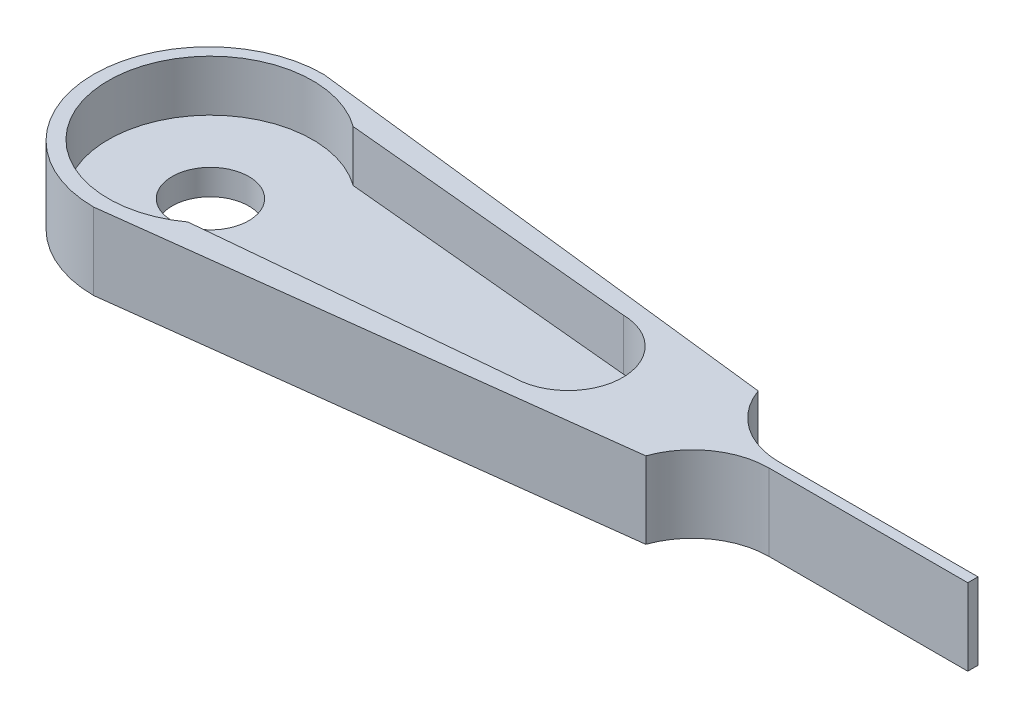
ISO-10303-21;
HEADER;
FILE_DESCRIPTION(('STEP AP214'),'2;1');
FILE_NAME('part.step','',(''),(''),'','','');
FILE_SCHEMA(('AUTOMOTIVE_DESIGN { 1 0 10303 214 1 1 1 1 }'));
ENDSEC;
DATA;
#1=APPLICATION_CONTEXT('core data for automotive mechanical design processes');
#2=APPLICATION_PROTOCOL_DEFINITION('international standard','automotive_design',2000,#1);
#3=PRODUCT_CONTEXT('',#1,'mechanical');
#4=PRODUCT('Part','Part','',(#3));
#5=PRODUCT_RELATED_PRODUCT_CATEGORY('part','',(#4));
#6=PRODUCT_DEFINITION_FORMATION('','',#4);
#7=PRODUCT_DEFINITION_CONTEXT('part definition',#1,'design');
#8=PRODUCT_DEFINITION('design','',#6,#7);
#9=PRODUCT_DEFINITION_SHAPE('','',#8);
#10=(LENGTH_UNIT() NAMED_UNIT(*) SI_UNIT(.MILLI.,.METRE.));
#11=(NAMED_UNIT(*) PLANE_ANGLE_UNIT() SI_UNIT($,.RADIAN.));
#12=(NAMED_UNIT(*) SI_UNIT($,.STERADIAN.) SOLID_ANGLE_UNIT());
#13=UNCERTAINTY_MEASURE_WITH_UNIT(LENGTH_MEASURE(1.E-05),#10,'distance_accuracy_value','');
#14=(GEOMETRIC_REPRESENTATION_CONTEXT(3) GLOBAL_UNCERTAINTY_ASSIGNED_CONTEXT((#13)) GLOBAL_UNIT_ASSIGNED_CONTEXT((#10,
#11,#12)) REPRESENTATION_CONTEXT('',''));
#15=CARTESIAN_POINT('',(0.,0.,0.));
#16=DIRECTION('',(0.,0.,1.));
#17=DIRECTION('',(1.,0.,0.));
#18=AXIS2_PLACEMENT_3D('',#15,#16,#17);
#19=CARTESIAN_POINT('',(-26.9871078638368,1.,0.));
#20=DIRECTION('',(0.,-1.,0.));
#21=DIRECTION('',(0.,0.,-1.));
#22=AXIS2_PLACEMENT_3D('',#19,#20,#21);
#23=CYLINDRICAL_SURFACE('',#22,1.5);
#24=CARTESIAN_POINT('',(-26.9871078638368,1.,0.));
#25=DIRECTION('',(0.,1.,0.));
#26=DIRECTION('',(0.,0.,1.));
#27=AXIS2_PLACEMENT_3D('',#24,#25,#26);
#28=CIRCLE('',#27,1.5);
#29=CARTESIAN_POINT('',(-26.9871078638368,1.,1.5));
#30=VERTEX_POINT('',#29);
#31=EDGE_CURVE('E253',#30,#30,#28,.T.);
#32=ORIENTED_EDGE('',*,*,#31,.T.);
#33=EDGE_LOOP('',(#32));
#34=FACE_BOUND('',#33,.T.);
#35=CARTESIAN_POINT('',(-26.9871078638368,0.,0.));
#36=DIRECTION('',(0.,1.,0.));
#37=DIRECTION('',(0.,0.,1.));
#38=AXIS2_PLACEMENT_3D('',#35,#36,#37);
#39=CIRCLE('',#38,1.5);
#40=CARTESIAN_POINT('',(-26.9871078638368,0.,1.5));
#41=VERTEX_POINT('',#40);
#42=EDGE_CURVE('E232',#41,#41,#39,.T.);
#43=ORIENTED_EDGE('',*,*,#42,.F.);
#44=EDGE_LOOP('',(#43));
#45=FACE_BOUND('',#44,.T.);
#46=ADVANCED_FACE('F45',(#34,#45),#23,.F.);
#47=CARTESIAN_POINT('',(0.,1.,0.));
#48=DIRECTION('',(0.,1.,0.));
#49=DIRECTION('',(0.,0.,1.));
#50=AXIS2_PLACEMENT_3D('',#47,#48,#49);
#51=PLANE('',#50);
#52=CARTESIAN_POINT('',(-26.9871078638368,1.,0.));
#53=DIRECTION('',(0.,1.,0.));
#54=DIRECTION('',(0.,0.,1.));
#55=AXIS2_PLACEMENT_3D('',#52,#53,#54);
#56=CIRCLE('',#55,4.);
#57=CARTESIAN_POINT('',(-24.6336953234997,1.,-3.23441639480509));
#58=VERTEX_POINT('',#57);
#59=CARTESIAN_POINT('',(-24.6336953234997,1.,3.23441639480509));
#60=VERTEX_POINT('',#59);
#61=EDGE_CURVE('E240',#58,#60,#56,.T.);
#62=ORIENTED_EDGE('',*,*,#61,.T.);
#63=DIRECTION('',(-0.995556490145002,0.,0.0941662090676083));
#64=VECTOR('',#63,1.);
#65=CARTESIAN_POINT('',(0.0847856095362401,1.,0.896381671094999));
#66=LINE('',#65,#64);
#67=CARTESIAN_POINT('',(-12.9619425776495,1.,2.13042609377146));
#68=VERTEX_POINT('',#67);
#69=EDGE_CURVE('E153',#68,#60,#66,.T.);
#70=ORIENTED_EDGE('',*,*,#69,.F.);
#71=CARTESIAN_POINT('',(-12.9871078638368,1.,0.));
#72=DIRECTION('',(0.,1.,0.));
#73=DIRECTION('',(0.,0.,1.));
#74=AXIS2_PLACEMENT_3D('',#71,#72,#73);
#75=CIRCLE('',#74,2.13057471886137);
#76=CARTESIAN_POINT('',(-12.9619425776495,1.,-2.13042609377146));
#77=VERTEX_POINT('',#76);
#78=EDGE_CURVE('E245',#68,#77,#75,.T.);
#79=ORIENTED_EDGE('',*,*,#78,.T.);
#80=DIRECTION('',(0.995556490145002,0.,0.0941662090676083));
#81=VECTOR('',#80,1.);
#82=CARTESIAN_POINT('',(0.0847856095362401,1.,-0.896381671094999));
#83=LINE('',#82,#81);
#84=EDGE_CURVE('E249',#58,#77,#83,.T.);
#85=ORIENTED_EDGE('',*,*,#84,.F.);
#86=EDGE_LOOP('',(#62,#70,#79,#85));
#87=FACE_BOUND('',#86,.T.);
#88=ORIENTED_EDGE('',*,*,#31,.F.);
#89=EDGE_LOOP('',(#88));
#90=FACE_BOUND('',#89,.T.);
#91=ADVANCED_FACE('F313',(#87,#90),#51,.T.);
#92=CARTESIAN_POINT('',(0.,0.,0.));
#93=DIRECTION('',(0.,1.,0.));
#94=DIRECTION('',(0.,0.,1.));
#95=AXIS2_PLACEMENT_3D('',#92,#93,#94);
#96=PLANE('',#95);
#97=ORIENTED_EDGE('',*,*,#42,.T.);
#98=EDGE_LOOP('',(#97));
#99=FACE_BOUND('',#98,.T.);
#100=CARTESIAN_POINT('',(-26.9871078638368,0.,0.0716470360661251));
#101=DIRECTION('',(0.,1.,0.));
#102=DIRECTION('',(0.,0.,1.));
#103=AXIS2_PLACEMENT_3D('',#100,#101,#102);
#104=CIRCLE('',#103,4.5);
#105=CARTESIAN_POINT('',(-26.9871078638368,0.,-4.42835296393388));
#106=VERTEX_POINT('',#105);
#107=CARTESIAN_POINT('',(-26.9871078638368,0.,4.57164703606613));
#108=VERTEX_POINT('',#107);
#109=EDGE_CURVE('E192',#106,#108,#104,.T.);
#110=ORIENTED_EDGE('',*,*,#109,.F.);
#111=DIRECTION('',(0.993357961620938,0.,0.115065025460798));
#112=VECTOR('',#111,1.);
#113=CARTESIAN_POINT('',(0.148855874634569,0.,-1.28507483147148));
#114=LINE('',#113,#112);
#115=CARTESIAN_POINT('',(-7.74970580216982,0.,-2.2));
#116=VERTEX_POINT('',#115);
#117=EDGE_CURVE('E147',#106,#116,#114,.T.);
#118=ORIENTED_EDGE('',*,*,#117,.T.);
#119=CARTESIAN_POINT('',(-4.92127867742363,0.,-3.2));
#120=DIRECTION('',(0.,1.,0.));
#121=DIRECTION('',(0.,0.,1.));
#122=AXIS2_PLACEMENT_3D('',#119,#120,#121);
#123=CIRCLE('',#122,3.);
#124=CARTESIAN_POINT('',(-4.92127867742363,0.,-0.199999999999999));
#125=VERTEX_POINT('',#124);
#126=EDGE_CURVE('E54',#116,#125,#123,.T.);
#127=ORIENTED_EDGE('',*,*,#126,.T.);
#128=DIRECTION('',(-1.,0.,0.));
#129=VECTOR('',#128,1.);
#130=CARTESIAN_POINT('',(0.,0.,-0.2));
#131=LINE('',#130,#129);
#132=CARTESIAN_POINT('',(2.85154686155549,0.,-0.2));
#133=VERTEX_POINT('',#132);
#134=EDGE_CURVE('E206',#133,#125,#131,.T.);
#135=ORIENTED_EDGE('',*,*,#134,.F.);
#136=DIRECTION('',(0.,0.,-1.));
#137=VECTOR('',#136,1.);
#138=CARTESIAN_POINT('',(2.85154686155549,0.,0.));
#139=LINE('',#138,#137);
#140=CARTESIAN_POINT('',(2.85154686155549,0.,0.2));
#141=VERTEX_POINT('',#140);
#142=EDGE_CURVE('E203',#141,#133,#139,.T.);
#143=ORIENTED_EDGE('',*,*,#142,.F.);
#144=DIRECTION('',(1.,0.,0.));
#145=VECTOR('',#144,1.);
#146=CARTESIAN_POINT('',(0.,0.,0.2));
#147=LINE('',#146,#145);
#148=CARTESIAN_POINT('',(-4.92127867742363,0.,0.2));
#149=VERTEX_POINT('',#148);
#150=EDGE_CURVE('E200',#149,#141,#147,.T.);
#151=ORIENTED_EDGE('',*,*,#150,.F.);
#152=CARTESIAN_POINT('',(-4.92127867742363,0.,3.2));
#153=DIRECTION('',(0.,1.,0.));
#154=DIRECTION('',(0.,0.,1.));
#155=AXIS2_PLACEMENT_3D('',#152,#153,#154);
#156=CIRCLE('',#155,3.);
#157=CARTESIAN_POINT('',(-7.74970580216982,0.,2.2));
#158=VERTEX_POINT('',#157);
#159=EDGE_CURVE('E266',#149,#158,#156,.T.);
#160=ORIENTED_EDGE('',*,*,#159,.T.);
#161=DIRECTION('',(-0.992486178328528,0.,0.122356797223662));
#162=VECTOR('',#161,1.);
#163=CARTESIAN_POINT('',(0.151140060484303,0.,1.22595903477441));
#164=LINE('',#163,#162);
#165=EDGE_CURVE('E196',#158,#108,#164,.T.);
#166=ORIENTED_EDGE('',*,*,#165,.T.);
#167=EDGE_LOOP('',(#110,#118,#127,#135,#143,#151,#160,#166));
#168=FACE_BOUND('',#167,.T.);
#169=ADVANCED_FACE('F285',(#99,#168),#96,.F.);
#170=CARTESIAN_POINT('',(-26.9871078638368,3.,0.0716470360661251));
#171=DIRECTION('',(0.,-1.,0.));
#172=DIRECTION('',(0.,0.,-1.));
#173=AXIS2_PLACEMENT_3D('',#170,#171,#172);
#174=CYLINDRICAL_SURFACE('',#173,4.5);
#175=ORIENTED_EDGE('',*,*,#109,.T.);
#176=DIRECTION('',(0.,-1.,0.));
#177=VECTOR('',#176,1.);
#178=CARTESIAN_POINT('',(-26.9871078638368,3.,4.57164703606613));
#179=LINE('',#178,#177);
#180=CARTESIAN_POINT('',(-26.9871078638368,3.,4.57164703606613));
#181=VERTEX_POINT('',#180);
#182=EDGE_CURVE('E229',#181,#108,#179,.T.);
#183=ORIENTED_EDGE('',*,*,#182,.F.);
#184=CARTESIAN_POINT('',(-26.9871078638368,3.,0.0716470360661251));
#185=DIRECTION('',(0.,1.,0.));
#186=DIRECTION('',(0.,0.,1.));
#187=AXIS2_PLACEMENT_3D('',#184,#185,#186);
#188=CIRCLE('',#187,4.5);
#189=CARTESIAN_POINT('',(-26.9871078638368,3.,-4.42835296393388));
#190=VERTEX_POINT('',#189);
#191=EDGE_CURVE('E171',#190,#181,#188,.T.);
#192=ORIENTED_EDGE('',*,*,#191,.F.);
#193=DIRECTION('',(0.,-1.,0.));
#194=VECTOR('',#193,1.);
#195=CARTESIAN_POINT('',(-26.9871078638368,3.,-4.42835296393388));
#196=LINE('',#195,#194);
#197=EDGE_CURVE('E157',#190,#106,#196,.T.);
#198=ORIENTED_EDGE('',*,*,#197,.T.);
#199=EDGE_LOOP('',(#175,#183,#192,#198));
#200=FACE_BOUND('',#199,.T.);
#201=ADVANCED_FACE('F292',(#200),#174,.T.);
#202=CARTESIAN_POINT('',(0.151140060484303,3.,1.22595903477441));
#203=DIRECTION('',(0.122356797223662,0.,0.992486178328528));
#204=DIRECTION('',(0.992486178328528,0.,-0.122356797223662));
#205=AXIS2_PLACEMENT_3D('',#202,#203,#204);
#206=PLANE('',#205);
#207=ORIENTED_EDGE('',*,*,#165,.F.);
#208=DIRECTION('',(0.,-1.,0.));
#209=VECTOR('',#208,1.);
#210=CARTESIAN_POINT('',(-7.74970580216982,3.,2.2));
#211=LINE('',#210,#209);
#212=CARTESIAN_POINT('',(-7.74970580216982,3.,2.2));
#213=VERTEX_POINT('',#212);
#214=EDGE_CURVE('E225',#213,#158,#211,.T.);
#215=ORIENTED_EDGE('',*,*,#214,.F.);
#216=DIRECTION('',(-0.992486178328528,0.,0.122356797223662));
#217=VECTOR('',#216,1.);
#218=CARTESIAN_POINT('',(0.151140060484303,3.,1.22595903477441));
#219=LINE('',#218,#217);
#220=EDGE_CURVE('E174',#213,#181,#219,.T.);
#221=ORIENTED_EDGE('',*,*,#220,.T.);
#222=ORIENTED_EDGE('',*,*,#182,.T.);
#223=EDGE_LOOP('',(#207,#215,#221,#222));
#224=FACE_BOUND('',#223,.T.);
#225=ADVANCED_FACE('F288',(#224),#206,.T.);
#226=CARTESIAN_POINT('',(0.,3.,0.2));
#227=DIRECTION('',(0.,0.,-1.));
#228=DIRECTION('',(-1.,0.,0.));
#229=AXIS2_PLACEMENT_3D('',#226,#227,#228);
#230=PLANE('',#229);
#231=DIRECTION('',(1.,0.,0.));
#232=VECTOR('',#231,1.);
#233=CARTESIAN_POINT('',(0.,3.,0.2));
#234=LINE('',#233,#232);
#235=CARTESIAN_POINT('',(-4.92127867742363,3.,0.2));
#236=VERTEX_POINT('',#235);
#237=CARTESIAN_POINT('',(2.85154686155549,3.,0.2));
#238=VERTEX_POINT('',#237);
#239=EDGE_CURVE('E178',#236,#238,#234,.T.);
#240=ORIENTED_EDGE('',*,*,#239,.F.);
#241=DIRECTION('',(0.,1.,0.));
#242=VECTOR('',#241,1.);
#243=CARTESIAN_POINT('',(-4.92127867742363,3.,0.2));
#244=LINE('',#243,#242);
#245=EDGE_CURVE('E257',#236,#149,#244,.F.);
#246=ORIENTED_EDGE('',*,*,#245,.T.);
#247=ORIENTED_EDGE('',*,*,#150,.T.);
#248=DIRECTION('',(0.,-1.,0.));
#249=VECTOR('',#248,1.);
#250=CARTESIAN_POINT('',(2.85154686155549,3.,0.2));
#251=LINE('',#250,#249);
#252=EDGE_CURVE('E221',#238,#141,#251,.T.);
#253=ORIENTED_EDGE('',*,*,#252,.F.);
#254=EDGE_LOOP('',(#240,#246,#247,#253));
#255=FACE_BOUND('',#254,.T.);
#256=ADVANCED_FACE('F279',(#255),#230,.F.);
#257=CARTESIAN_POINT('',(2.85154686155549,3.,0.));
#258=DIRECTION('',(-1.,0.,0.));
#259=DIRECTION('',(0.,0.,1.));
#260=AXIS2_PLACEMENT_3D('',#257,#258,#259);
#261=PLANE('',#260);
#262=ORIENTED_EDGE('',*,*,#142,.T.);
#263=DIRECTION('',(0.,-1.,0.));
#264=VECTOR('',#263,1.);
#265=CARTESIAN_POINT('',(2.85154686155549,3.,-0.2));
#266=LINE('',#265,#264);
#267=CARTESIAN_POINT('',(2.85154686155549,3.,-0.2));
#268=VERTEX_POINT('',#267);
#269=EDGE_CURVE('E217',#268,#133,#266,.T.);
#270=ORIENTED_EDGE('',*,*,#269,.F.);
#271=DIRECTION('',(0.,0.,-1.));
#272=VECTOR('',#271,1.);
#273=CARTESIAN_POINT('',(2.85154686155549,3.,0.));
#274=LINE('',#273,#272);
#275=EDGE_CURVE('E181',#238,#268,#274,.T.);
#276=ORIENTED_EDGE('',*,*,#275,.F.);
#277=ORIENTED_EDGE('',*,*,#252,.T.);
#278=EDGE_LOOP('',(#262,#270,#276,#277));
#279=FACE_BOUND('',#278,.T.);
#280=ADVANCED_FACE('F303',(#279),#261,.F.);
#281=CARTESIAN_POINT('',(0.,3.,-0.2));
#282=DIRECTION('',(0.,0.,1.));
#283=DIRECTION('',(1.,0.,0.));
#284=AXIS2_PLACEMENT_3D('',#281,#282,#283);
#285=PLANE('',#284);
#286=ORIENTED_EDGE('',*,*,#134,.T.);
#287=DIRECTION('',(0.,-1.,0.));
#288=VECTOR('',#287,1.);
#289=CARTESIAN_POINT('',(-4.92127867742363,3.,-0.199999999999999));
#290=LINE('',#289,#288);
#291=CARTESIAN_POINT('',(-4.92127867742363,3.,-0.199999999999999));
#292=VERTEX_POINT('',#291);
#293=EDGE_CURVE('E61',#125,#292,#290,.F.);
#294=ORIENTED_EDGE('',*,*,#293,.T.);
#295=DIRECTION('',(-1.,0.,0.));
#296=VECTOR('',#295,1.);
#297=CARTESIAN_POINT('',(0.,3.,-0.2));
#298=LINE('',#297,#296);
#299=EDGE_CURVE('E184',#268,#292,#298,.T.);
#300=ORIENTED_EDGE('',*,*,#299,.F.);
#301=ORIENTED_EDGE('',*,*,#269,.T.);
#302=EDGE_LOOP('',(#286,#294,#300,#301));
#303=FACE_BOUND('',#302,.T.);
#304=ADVANCED_FACE('F301',(#303),#285,.F.);
#305=CARTESIAN_POINT('',(0.0847856095362401,3.,0.896381671094999));
#306=DIRECTION('',(0.0941662090676083,0.,0.995556490145002));
#307=DIRECTION('',(0.995556490145002,0.,-0.0941662090676083));
#308=AXIS2_PLACEMENT_3D('',#305,#306,#307);
#309=PLANE('',#308);
#310=ORIENTED_EDGE('',*,*,#69,.T.);
#311=DIRECTION('',(0.,-1.,0.));
#312=VECTOR('',#311,1.);
#313=CARTESIAN_POINT('',(-24.6336953234997,3.,3.23441639480509));
#314=LINE('',#313,#312);
#315=CARTESIAN_POINT('',(-24.6336953234997,3.,3.23441639480509));
#316=VERTEX_POINT('',#315);
#317=EDGE_CURVE('E150',#316,#60,#314,.T.);
#318=ORIENTED_EDGE('',*,*,#317,.F.);
#319=DIRECTION('',(-0.995556490145002,0.,0.0941662090676083));
#320=VECTOR('',#319,1.);
#321=CARTESIAN_POINT('',(0.0847856095362401,3.,0.896381671094999));
#322=LINE('',#321,#320);
#323=CARTESIAN_POINT('',(-12.9619425776495,3.,2.13042609377146));
#324=VERTEX_POINT('',#323);
#325=EDGE_CURVE('E136',#324,#316,#322,.T.);
#326=ORIENTED_EDGE('',*,*,#325,.F.);
#327=DIRECTION('',(0.,-1.,0.));
#328=VECTOR('',#327,1.);
#329=CARTESIAN_POINT('',(-12.9619425776495,3.,2.13042609377146));
#330=LINE('',#329,#328);
#331=EDGE_CURVE('E191',#324,#68,#330,.T.);
#332=ORIENTED_EDGE('',*,*,#331,.T.);
#333=EDGE_LOOP('',(#310,#318,#326,#332));
#334=FACE_BOUND('',#333,.T.);
#335=ADVANCED_FACE('F151',(#334),#309,.F.);
#336=CARTESIAN_POINT('',(-26.9871078638368,3.,0.));
#337=DIRECTION('',(0.,-1.,0.));
#338=DIRECTION('',(0.,0.,-1.));
#339=AXIS2_PLACEMENT_3D('',#336,#337,#338);
#340=CYLINDRICAL_SURFACE('',#339,4.);
#341=ORIENTED_EDGE('',*,*,#317,.T.);
#342=ORIENTED_EDGE('',*,*,#61,.F.);
#343=DIRECTION('',(0.,-1.,0.));
#344=VECTOR('',#343,1.);
#345=CARTESIAN_POINT('',(-24.6336953234997,3.,-3.23441639480509));
#346=LINE('',#345,#344);
#347=CARTESIAN_POINT('',(-24.6336953234997,3.,-3.23441639480509));
#348=VERTEX_POINT('',#347);
#349=EDGE_CURVE('E158',#348,#58,#346,.T.);
#350=ORIENTED_EDGE('',*,*,#349,.F.);
#351=CARTESIAN_POINT('',(-26.9871078638368,3.,0.));
#352=DIRECTION('',(0.,1.,0.));
#353=DIRECTION('',(0.,0.,1.));
#354=AXIS2_PLACEMENT_3D('',#351,#352,#353);
#355=CIRCLE('',#354,4.);
#356=EDGE_CURVE('E141',#348,#316,#355,.T.);
#357=ORIENTED_EDGE('',*,*,#356,.T.);
#358=EDGE_LOOP('',(#341,#342,#350,#357));
#359=FACE_BOUND('',#358,.T.);
#360=ADVANCED_FACE('F160',(#359),#340,.F.);
#361=CARTESIAN_POINT('',(0.0847856095362401,3.,-0.896381671094999));
#362=DIRECTION('',(0.0941662090676083,0.,-0.995556490145002));
#363=DIRECTION('',(-0.995556490145002,0.,-0.0941662090676083));
#364=AXIS2_PLACEMENT_3D('',#361,#362,#363);
#365=PLANE('',#364);
#366=ORIENTED_EDGE('',*,*,#84,.T.);
#367=DIRECTION('',(0.,-1.,0.));
#368=VECTOR('',#367,1.);
#369=CARTESIAN_POINT('',(-12.9619425776495,3.,-2.13042609377146));
#370=LINE('',#369,#368);
#371=CARTESIAN_POINT('',(-12.9619425776495,3.,-2.13042609377146));
#372=VERTEX_POINT('',#371);
#373=EDGE_CURVE('E235',#372,#77,#370,.T.);
#374=ORIENTED_EDGE('',*,*,#373,.F.);
#375=DIRECTION('',(0.995556490145002,0.,0.0941662090676083));
#376=VECTOR('',#375,1.);
#377=CARTESIAN_POINT('',(0.0847856095362401,3.,-0.896381671094999));
#378=LINE('',#377,#376);
#379=EDGE_CURVE('E164',#348,#372,#378,.T.);
#380=ORIENTED_EDGE('',*,*,#379,.F.);
#381=ORIENTED_EDGE('',*,*,#349,.T.);
#382=EDGE_LOOP('',(#366,#374,#380,#381));
#383=FACE_BOUND('',#382,.T.);
#384=ADVANCED_FACE('F337',(#383),#365,.F.);
#385=CARTESIAN_POINT('',(-12.9871078638368,3.,0.));
#386=DIRECTION('',(0.,-1.,0.));
#387=DIRECTION('',(0.,0.,-1.));
#388=AXIS2_PLACEMENT_3D('',#385,#386,#387);
#389=CYLINDRICAL_SURFACE('',#388,2.13057471886137);
#390=ORIENTED_EDGE('',*,*,#373,.T.);
#391=ORIENTED_EDGE('',*,*,#78,.F.);
#392=ORIENTED_EDGE('',*,*,#331,.F.);
#393=CARTESIAN_POINT('',(-12.9871078638368,3.,0.));
#394=DIRECTION('',(0.,1.,0.));
#395=DIRECTION('',(0.,0.,1.));
#396=AXIS2_PLACEMENT_3D('',#393,#394,#395);
#397=CIRCLE('',#396,2.13057471886137);
#398=EDGE_CURVE('E143',#324,#372,#397,.T.);
#399=ORIENTED_EDGE('',*,*,#398,.T.);
#400=EDGE_LOOP('',(#390,#391,#392,#399));
#401=FACE_BOUND('',#400,.T.);
#402=ADVANCED_FACE('F332',(#401),#389,.F.);
#403=CARTESIAN_POINT('',(0.148855874634569,3.,-1.28507483147148));
#404=DIRECTION('',(0.115065025460798,0.,-0.993357961620938));
#405=DIRECTION('',(-0.993357961620938,0.,-0.115065025460798));
#406=AXIS2_PLACEMENT_3D('',#403,#404,#405);
#407=PLANE('',#406);
#408=ORIENTED_EDGE('',*,*,#117,.F.);
#409=ORIENTED_EDGE('',*,*,#197,.F.);
#410=DIRECTION('',(0.993357961620938,0.,0.115065025460798));
#411=VECTOR('',#410,1.);
#412=CARTESIAN_POINT('',(0.148855874634569,3.,-1.28507483147148));
#413=LINE('',#412,#411);
#414=CARTESIAN_POINT('',(-7.74970580216982,3.,-2.2));
#415=VERTEX_POINT('',#414);
#416=EDGE_CURVE('E187',#190,#415,#413,.T.);
#417=ORIENTED_EDGE('',*,*,#416,.T.);
#418=DIRECTION('',(0.,-1.,0.));
#419=VECTOR('',#418,1.);
#420=CARTESIAN_POINT('',(-7.74970580216982,3.,-2.2));
#421=LINE('',#420,#419);
#422=EDGE_CURVE('E213',#415,#116,#421,.T.);
#423=ORIENTED_EDGE('',*,*,#422,.T.);
#424=EDGE_LOOP('',(#408,#409,#417,#423));
#425=FACE_BOUND('',#424,.T.);
#426=ADVANCED_FACE('F295',(#425),#407,.T.);
#427=CARTESIAN_POINT('',(0.,3.,0.));
#428=DIRECTION('',(0.,1.,0.));
#429=DIRECTION('',(0.,0.,1.));
#430=AXIS2_PLACEMENT_3D('',#427,#428,#429);
#431=PLANE('',#430);
#432=ORIENTED_EDGE('',*,*,#325,.T.);
#433=ORIENTED_EDGE('',*,*,#356,.F.);
#434=ORIENTED_EDGE('',*,*,#379,.T.);
#435=ORIENTED_EDGE('',*,*,#398,.F.);
#436=EDGE_LOOP('',(#432,#433,#434,#435));
#437=FACE_BOUND('',#436,.T.);
#438=ORIENTED_EDGE('',*,*,#191,.T.);
#439=ORIENTED_EDGE('',*,*,#220,.F.);
#440=CARTESIAN_POINT('',(-4.92127867742363,3.,3.2));
#441=DIRECTION('',(0.,1.,0.));
#442=DIRECTION('',(0.,0.,1.));
#443=AXIS2_PLACEMENT_3D('',#440,#441,#442);
#444=CIRCLE('',#443,3.);
#445=EDGE_CURVE('E269',#213,#236,#444,.F.);
#446=ORIENTED_EDGE('',*,*,#445,.T.);
#447=ORIENTED_EDGE('',*,*,#239,.T.);
#448=ORIENTED_EDGE('',*,*,#275,.T.);
#449=ORIENTED_EDGE('',*,*,#299,.T.);
#450=CARTESIAN_POINT('',(-4.92127867742363,3.,-3.2));
#451=DIRECTION('',(0.,1.,0.));
#452=DIRECTION('',(0.,0.,1.));
#453=AXIS2_PLACEMENT_3D('',#450,#451,#452);
#454=CIRCLE('',#453,3.);
#455=EDGE_CURVE('E11',#292,#415,#454,.F.);
#456=ORIENTED_EDGE('',*,*,#455,.T.);
#457=ORIENTED_EDGE('',*,*,#416,.F.);
#458=EDGE_LOOP('',(#438,#439,#446,#447,#448,#449,#456,#457));
#459=FACE_BOUND('',#458,.T.);
#460=ADVANCED_FACE('F138',(#437,#459),#431,.T.);
#461=CARTESIAN_POINT('',(-4.92127867742363,3.,3.2));
#462=DIRECTION('',(0.,1.,0.));
#463=DIRECTION('',(0.,0.,1.));
#464=AXIS2_PLACEMENT_3D('',#461,#462,#463);
#465=CYLINDRICAL_SURFACE('',#464,3.);
#466=ORIENTED_EDGE('',*,*,#445,.F.);
#467=ORIENTED_EDGE('',*,*,#214,.T.);
#468=ORIENTED_EDGE('',*,*,#159,.F.);
#469=ORIENTED_EDGE('',*,*,#245,.F.);
#470=EDGE_LOOP('',(#466,#467,#468,#469));
#471=FACE_BOUND('',#470,.T.);
#472=ADVANCED_FACE('F282',(#471),#465,.F.);
#473=CARTESIAN_POINT('',(-4.92127867742363,3.,-3.2));
#474=DIRECTION('',(0.,-1.,0.));
#475=DIRECTION('',(0.,0.,-1.));
#476=AXIS2_PLACEMENT_3D('',#473,#474,#475);
#477=CYLINDRICAL_SURFACE('',#476,3.);
#478=ORIENTED_EDGE('',*,*,#455,.F.);
#479=ORIENTED_EDGE('',*,*,#293,.F.);
#480=ORIENTED_EDGE('',*,*,#126,.F.);
#481=ORIENTED_EDGE('',*,*,#422,.F.);
#482=EDGE_LOOP('',(#478,#479,#480,#481));
#483=FACE_BOUND('',#482,.T.);
#484=ADVANCED_FACE('F47',(#483),#477,.F.);
#485=CLOSED_SHELL('',(#46,#91,#169,#201,#225,#256,#280,#304,#335,#360,#384,#402,#426,#460,#472,#484));
#486=MANIFOLD_SOLID_BREP('B2',#485);
#487=ADVANCED_BREP_SHAPE_REPRESENTATION('',(#18,#486),#14);
#488=SHAPE_DEFINITION_REPRESENTATION(#9,#487);
ENDSEC;
END-ISO-10303-21;
